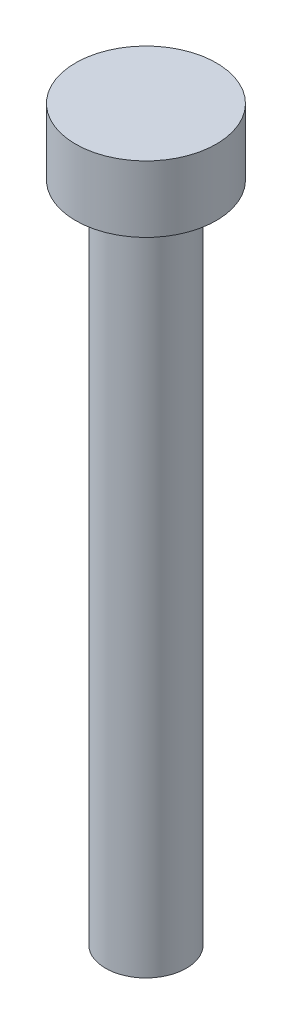
ISO-10303-21;
HEADER;
FILE_DESCRIPTION(('STEP AP214'),'2;1');
FILE_NAME('part.step','',(''),(''),'','','');
FILE_SCHEMA(('AUTOMOTIVE_DESIGN { 1 0 10303 214 1 1 1 1 }'));
ENDSEC;
DATA;
#1=APPLICATION_CONTEXT('core data for automotive mechanical design processes');
#2=APPLICATION_PROTOCOL_DEFINITION('international standard','automotive_design',2000,#1);
#3=PRODUCT_CONTEXT('',#1,'mechanical');
#4=PRODUCT('Part','Part','',(#3));
#5=PRODUCT_RELATED_PRODUCT_CATEGORY('part','',(#4));
#6=PRODUCT_DEFINITION_FORMATION('','',#4);
#7=PRODUCT_DEFINITION_CONTEXT('part definition',#1,'design');
#8=PRODUCT_DEFINITION('design','',#6,#7);
#9=PRODUCT_DEFINITION_SHAPE('','',#8);
#10=(LENGTH_UNIT() NAMED_UNIT(*) SI_UNIT(.MILLI.,.METRE.));
#11=(NAMED_UNIT(*) PLANE_ANGLE_UNIT() SI_UNIT($,.RADIAN.));
#12=(NAMED_UNIT(*) SI_UNIT($,.STERADIAN.) SOLID_ANGLE_UNIT());
#13=UNCERTAINTY_MEASURE_WITH_UNIT(LENGTH_MEASURE(1.E-05),#10,'distance_accuracy_value','');
#14=(GEOMETRIC_REPRESENTATION_CONTEXT(3) GLOBAL_UNCERTAINTY_ASSIGNED_CONTEXT((#13)) GLOBAL_UNIT_ASSIGNED_CONTEXT((#10,
#11,#12)) REPRESENTATION_CONTEXT('',''));
#15=CARTESIAN_POINT('',(0.,0.,0.));
#16=DIRECTION('',(0.,0.,1.));
#17=DIRECTION('',(1.,0.,0.));
#18=AXIS2_PLACEMENT_3D('',#15,#16,#17);
#19=CARTESIAN_POINT('',(0.,4.,0.));
#20=DIRECTION('',(0.,-1.,0.));
#21=DIRECTION('',(0.,0.,-1.));
#22=AXIS2_PLACEMENT_3D('',#19,#20,#21);
#23=CYLINDRICAL_SURFACE('',#22,4.25);
#24=CARTESIAN_POINT('',(0.,4.,0.));
#25=DIRECTION('',(0.,1.,0.));
#26=DIRECTION('',(0.,0.,1.));
#27=AXIS2_PLACEMENT_3D('',#24,#25,#26);
#28=CIRCLE('',#27,4.25);
#29=CARTESIAN_POINT('',(0.,4.,4.25));
#30=VERTEX_POINT('',#29);
#31=EDGE_CURVE('E40',#30,#30,#28,.T.);
#32=ORIENTED_EDGE('',*,*,#31,.F.);
#33=EDGE_LOOP('',(#32));
#34=FACE_BOUND('',#33,.T.);
#35=CARTESIAN_POINT('',(0.,0.,0.));
#36=DIRECTION('',(0.,1.,0.));
#37=DIRECTION('',(0.,0.,1.));
#38=AXIS2_PLACEMENT_3D('',#35,#36,#37);
#39=CIRCLE('',#38,4.25);
#40=CARTESIAN_POINT('',(0.,0.,4.25));
#41=VERTEX_POINT('',#40);
#42=EDGE_CURVE('E36',#41,#41,#39,.T.);
#43=ORIENTED_EDGE('',*,*,#42,.T.);
#44=EDGE_LOOP('',(#43));
#45=FACE_BOUND('',#44,.T.);
#46=ADVANCED_FACE('F33',(#34,#45),#23,.T.);
#47=CARTESIAN_POINT('',(0.,4.,0.));
#48=DIRECTION('',(0.,1.,0.));
#49=DIRECTION('',(0.,0.,1.));
#50=AXIS2_PLACEMENT_3D('',#47,#48,#49);
#51=PLANE('',#50);
#52=ORIENTED_EDGE('',*,*,#31,.T.);
#53=EDGE_LOOP('',(#52));
#54=FACE_BOUND('',#53,.T.);
#55=ADVANCED_FACE('F57',(#54),#51,.T.);
#56=CARTESIAN_POINT('',(0.,0.,0.));
#57=DIRECTION('',(0.,1.,0.));
#58=DIRECTION('',(0.,0.,1.));
#59=AXIS2_PLACEMENT_3D('',#56,#57,#58);
#60=PLANE('',#59);
#61=CARTESIAN_POINT('',(0.,0.,0.));
#62=DIRECTION('',(0.,-1.,0.));
#63=DIRECTION('',(0.,0.,-1.));
#64=AXIS2_PLACEMENT_3D('',#61,#62,#63);
#65=CIRCLE('',#64,2.44);
#66=CARTESIAN_POINT('',(0.,0.,-2.44));
#67=VERTEX_POINT('',#66);
#68=EDGE_CURVE('E10',#67,#67,#65,.T.);
#69=ORIENTED_EDGE('',*,*,#68,.F.);
#70=EDGE_LOOP('',(#69));
#71=FACE_BOUND('',#70,.T.);
#72=ORIENTED_EDGE('',*,*,#42,.F.);
#73=EDGE_LOOP('',(#72));
#74=FACE_BOUND('',#73,.T.);
#75=ADVANCED_FACE('F54',(#71,#74),#60,.F.);
#76=CARTESIAN_POINT('',(0.,-40.,0.));
#77=DIRECTION('',(0.,1.,0.));
#78=DIRECTION('',(0.,0.,1.));
#79=AXIS2_PLACEMENT_3D('',#76,#77,#78);
#80=CYLINDRICAL_SURFACE('',#79,2.44);
#81=CARTESIAN_POINT('',(0.,-40.,0.));
#82=DIRECTION('',(0.,-1.,0.));
#83=DIRECTION('',(0.,0.,-1.));
#84=AXIS2_PLACEMENT_3D('',#81,#82,#83);
#85=CIRCLE('',#84,2.44);
#86=CARTESIAN_POINT('',(0.,-40.,-2.44));
#87=VERTEX_POINT('',#86);
#88=EDGE_CURVE('E46',#87,#87,#85,.T.);
#89=ORIENTED_EDGE('',*,*,#88,.F.);
#90=EDGE_LOOP('',(#89));
#91=FACE_BOUND('',#90,.T.);
#92=ORIENTED_EDGE('',*,*,#68,.T.);
#93=EDGE_LOOP('',(#92));
#94=FACE_BOUND('',#93,.T.);
#95=ADVANCED_FACE('F56',(#91,#94),#80,.T.);
#96=CARTESIAN_POINT('',(0.,-40.,0.));
#97=DIRECTION('',(0.,-1.,0.));
#98=DIRECTION('',(0.,0.,-1.));
#99=AXIS2_PLACEMENT_3D('',#96,#97,#98);
#100=PLANE('',#99);
#101=ORIENTED_EDGE('',*,*,#88,.T.);
#102=EDGE_LOOP('',(#101));
#103=FACE_BOUND('',#102,.T.);
#104=ADVANCED_FACE('F63',(#103),#100,.T.);
#105=CLOSED_SHELL('',(#46,#55,#75,#95,#104));
#106=MANIFOLD_SOLID_BREP('B2',#105);
#107=ADVANCED_BREP_SHAPE_REPRESENTATION('',(#18,#106),#14);
#108=SHAPE_DEFINITION_REPRESENTATION(#9,#107);
ENDSEC;
END-ISO-10303-21;
